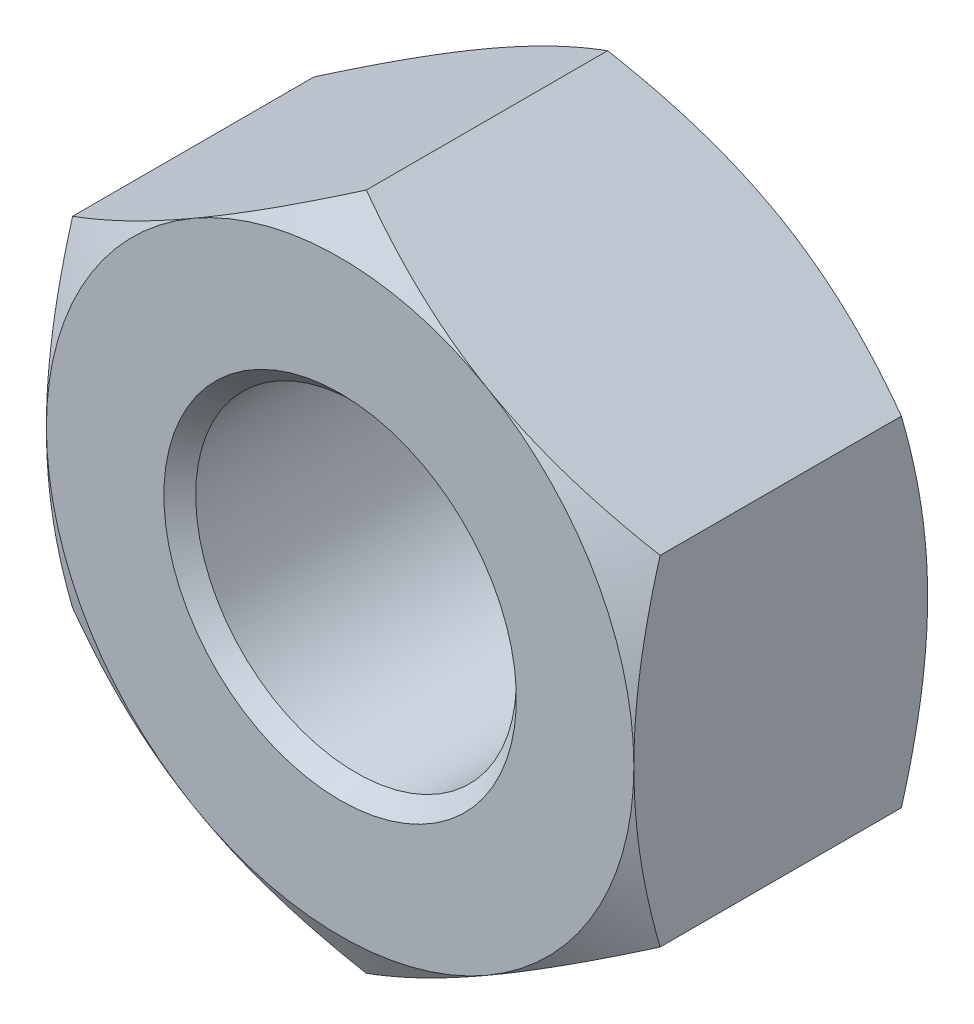
ISO-10303-21;
HEADER;
FILE_DESCRIPTION(('STEP AP214'),'2;1');
FILE_NAME('part.step','',(''),(''),'','','');
FILE_SCHEMA(('AUTOMOTIVE_DESIGN { 1 0 10303 214 1 1 1 1 }'));
ENDSEC;
DATA;
#1=APPLICATION_CONTEXT('core data for automotive mechanical design processes');
#2=APPLICATION_PROTOCOL_DEFINITION('international standard','automotive_design',2000,#1);
#3=PRODUCT_CONTEXT('',#1,'mechanical');
#4=PRODUCT('Part','Part','',(#3));
#5=PRODUCT_RELATED_PRODUCT_CATEGORY('part','',(#4));
#6=PRODUCT_DEFINITION_FORMATION('','',#4);
#7=PRODUCT_DEFINITION_CONTEXT('part definition',#1,'design');
#8=PRODUCT_DEFINITION('design','',#6,#7);
#9=PRODUCT_DEFINITION_SHAPE('','',#8);
#10=(LENGTH_UNIT() NAMED_UNIT(*) SI_UNIT(.MILLI.,.METRE.));
#11=(NAMED_UNIT(*) PLANE_ANGLE_UNIT() SI_UNIT($,.RADIAN.));
#12=(NAMED_UNIT(*) SI_UNIT($,.STERADIAN.) SOLID_ANGLE_UNIT());
#13=UNCERTAINTY_MEASURE_WITH_UNIT(LENGTH_MEASURE(1.E-05),#10,'distance_accuracy_value','');
#14=(GEOMETRIC_REPRESENTATION_CONTEXT(3) GLOBAL_UNCERTAINTY_ASSIGNED_CONTEXT((#13)) GLOBAL_UNIT_ASSIGNED_CONTEXT((#10,
#11,#12)) REPRESENTATION_CONTEXT('',''));
#15=CARTESIAN_POINT('',(0.,0.,0.));
#16=DIRECTION('',(0.,0.,1.));
#17=DIRECTION('',(1.,0.,0.));
#18=AXIS2_PLACEMENT_3D('',#15,#16,#17);
#19=CARTESIAN_POINT('',(2.5,-4.33012701892219,-1.));
#20=DIRECTION('',(0.5,-0.866025403784439,0.));
#21=DIRECTION('',(0.,0.,-1.));
#22=AXIS2_PLACEMENT_3D('',#19,#20,#21);
#23=PLANE('',#22);
#24=CARTESIAN_POINT('',(5.00000000000003,-2.88675134594812,0.446581987385214));
#25=CARTESIAN_POINT('',(3.6602540378444,-3.66025403784439,0.));
#26=CARTESIAN_POINT('',(2.5,-4.33012701892219,0.));
#27=(BOUNDED_CURVE() B_SPLINE_CURVE(2,(#24,#25,#26),.UNSPECIFIED.,.F.,
.F.) B_SPLINE_CURVE_WITH_KNOTS((3,3),(0.00272976051745168,2.9316581987571),
.UNSPECIFIED.) CURVE() GEOMETRIC_REPRESENTATION_ITEM() RATIONAL_B_SPLINE_CURVE((1.00007075032021,
1.0379915664716,1.)) REPRESENTATION_ITEM(''));
#28=CARTESIAN_POINT('',(5.,-2.88675134594813,0.446581987385204));
#29=VERTEX_POINT('',#28);
#30=CARTESIAN_POINT('',(2.5,-4.33012701892219,0.));
#31=VERTEX_POINT('',#30);
#32=EDGE_CURVE('E211',#29,#31,#27,.T.);
#33=ORIENTED_EDGE('',*,*,#32,.F.);
#34=DIRECTION('',(0.,0.,1.));
#35=VECTOR('',#34,1.);
#36=CARTESIAN_POINT('',(5.,-2.88675134594813,-1.));
#37=LINE('',#36,#35);
#38=CARTESIAN_POINT('',(5.,-2.88675134594813,4.5534180126148));
#39=VERTEX_POINT('',#38);
#40=EDGE_CURVE('E10',#29,#39,#37,.T.);
#41=ORIENTED_EDGE('',*,*,#40,.T.);
#42=CARTESIAN_POINT('',(2.5,-4.33012701892219,5.));
#43=CARTESIAN_POINT('',(3.6602540378444,-3.66025403784438,5.));
#44=CARTESIAN_POINT('',(5.00000000000003,-2.88675134594812,4.5534180126148));
#45=(BOUNDED_CURVE() B_SPLINE_CURVE(2,(#42,#43,#44),.UNSPECIFIED.,.F.,
.F.) B_SPLINE_CURVE_WITH_KNOTS((3,3),(2.9316581987571,5.86058663699675),
.UNSPECIFIED.) CURVE() GEOMETRIC_REPRESENTATION_ITEM() RATIONAL_B_SPLINE_CURVE((1.,
1.03799156647161,1.00007075032021)) REPRESENTATION_ITEM(''));
#46=CARTESIAN_POINT('',(2.5,-4.33012701892219,5.));
#47=VERTEX_POINT('',#46);
#48=EDGE_CURVE('E247',#47,#39,#45,.T.);
#49=ORIENTED_EDGE('',*,*,#48,.F.);
#50=CARTESIAN_POINT('',(0.,-5.77350269189628,4.55341801261479));
#51=CARTESIAN_POINT('',(1.3397459621556,-5.00000000000001,5.));
#52=CARTESIAN_POINT('',(2.5,-4.33012701892219,5.));
#53=(BOUNDED_CURVE() B_SPLINE_CURVE(2,(#50,#51,#52),.UNSPECIFIED.,.F.,
.F.) B_SPLINE_CURVE_WITH_KNOTS((3,3),(0.00272976051745616,2.9316581987571),
.UNSPECIFIED.) CURVE() GEOMETRIC_REPRESENTATION_ITEM() RATIONAL_B_SPLINE_CURVE((1.00007075032021,
1.03799156647161,1.)) REPRESENTATION_ITEM(''));
#54=CARTESIAN_POINT('',(0.,-5.77350269189626,4.5534180126148));
#55=VERTEX_POINT('',#54);
#56=EDGE_CURVE('E191',#55,#47,#53,.T.);
#57=ORIENTED_EDGE('',*,*,#56,.F.);
#58=DIRECTION('',(0.,0.,1.));
#59=VECTOR('',#58,1.);
#60=CARTESIAN_POINT('',(0.,-5.77350269189626,-1.));
#61=LINE('',#60,#59);
#62=CARTESIAN_POINT('',(0.,-5.77350269189626,0.446581987385204));
#63=VERTEX_POINT('',#62);
#64=EDGE_CURVE('E291',#63,#55,#61,.T.);
#65=ORIENTED_EDGE('',*,*,#64,.F.);
#66=CARTESIAN_POINT('',(2.5,-4.33012701892219,0.));
#67=CARTESIAN_POINT('',(1.33974596215561,-5.00000000000001,0.));
#68=CARTESIAN_POINT('',(0.,-5.77350269189627,0.446581987385213));
#69=(BOUNDED_CURVE() B_SPLINE_CURVE(2,(#66,#67,#68),.UNSPECIFIED.,.F.,
.F.) B_SPLINE_CURVE_WITH_KNOTS((3,3),(2.9316581987571,5.86058663699674),
.UNSPECIFIED.) CURVE() GEOMETRIC_REPRESENTATION_ITEM() RATIONAL_B_SPLINE_CURVE((1.,
1.03799156647161,1.00007075032021)) REPRESENTATION_ITEM(''));
#70=EDGE_CURVE('E185',#31,#63,#69,.T.);
#71=ORIENTED_EDGE('',*,*,#70,.F.);
#72=EDGE_LOOP('',(#33,#41,#49,#57,#65,#71));
#73=FACE_BOUND('',#72,.T.);
#74=ADVANCED_FACE('F15',(#73),#23,.T.);
#75=CARTESIAN_POINT('',(5.,0.,-1.));
#76=DIRECTION('',(1.,0.,0.));
#77=DIRECTION('',(0.,0.,-1.));
#78=AXIS2_PLACEMENT_3D('',#75,#76,#77);
#79=PLANE('',#78);
#80=CARTESIAN_POINT('',(5.00000000000001,2.88675134594816,0.446581987385212));
#81=CARTESIAN_POINT('',(5.,1.33974596215563,0.));
#82=CARTESIAN_POINT('',(5.,0.,0.));
#83=(BOUNDED_CURVE() B_SPLINE_CURVE(2,(#80,#81,#82),.UNSPECIFIED.,.F.,
.F.) B_SPLINE_CURVE_WITH_KNOTS((3,3),(0.00272976051745535,2.9316581987571),
.UNSPECIFIED.) CURVE() GEOMETRIC_REPRESENTATION_ITEM() RATIONAL_B_SPLINE_CURVE((1.00007075032021,
1.0379915664716,1.)) REPRESENTATION_ITEM(''));
#84=CARTESIAN_POINT('',(5.,2.88675134594813,0.446581987385203));
#85=VERTEX_POINT('',#84);
#86=CARTESIAN_POINT('',(5.,0.,0.));
#87=VERTEX_POINT('',#86);
#88=EDGE_CURVE('E265',#85,#87,#83,.T.);
#89=ORIENTED_EDGE('',*,*,#88,.F.);
#90=DIRECTION('',(0.,0.,1.));
#91=VECTOR('',#90,1.);
#92=CARTESIAN_POINT('',(5.,2.88675134594813,-1.));
#93=LINE('',#92,#91);
#94=CARTESIAN_POINT('',(5.,2.88675134594813,4.5534180126148));
#95=VERTEX_POINT('',#94);
#96=EDGE_CURVE('E25',#85,#95,#93,.T.);
#97=ORIENTED_EDGE('',*,*,#96,.T.);
#98=CARTESIAN_POINT('',(5.,0.,5.));
#99=CARTESIAN_POINT('',(5.,1.33974596215562,5.));
#100=CARTESIAN_POINT('',(5.,2.88675134594816,4.55341801261479));
#101=(BOUNDED_CURVE() B_SPLINE_CURVE(2,(#98,#99,#100),.UNSPECIFIED.,.F.,
.F.) B_SPLINE_CURVE_WITH_KNOTS((3,3),(2.9316581987571,5.86058663699674),
.UNSPECIFIED.) CURVE() GEOMETRIC_REPRESENTATION_ITEM() RATIONAL_B_SPLINE_CURVE((1.,
1.0379915664716,1.00007075032021)) REPRESENTATION_ITEM(''));
#102=CARTESIAN_POINT('',(5.,0.,5.));
#103=VERTEX_POINT('',#102);
#104=EDGE_CURVE('E168',#103,#95,#101,.T.);
#105=ORIENTED_EDGE('',*,*,#104,.F.);
#106=CARTESIAN_POINT('',(5.00000000000001,-2.88675134594816,4.5534180126148));
#107=CARTESIAN_POINT('',(5.,-1.33974596215562,5.));
#108=CARTESIAN_POINT('',(5.,0.,5.));
#109=(BOUNDED_CURVE() B_SPLINE_CURVE(2,(#106,#107,#108),.UNSPECIFIED.,.F.,
.F.) B_SPLINE_CURVE_WITH_KNOTS((3,3),(0.00272976051745627,2.9316581987571),
.UNSPECIFIED.) CURVE() GEOMETRIC_REPRESENTATION_ITEM() RATIONAL_B_SPLINE_CURVE((1.00007075032021,
1.0379915664716,1.)) REPRESENTATION_ITEM(''));
#110=EDGE_CURVE('E280',#39,#103,#109,.T.);
#111=ORIENTED_EDGE('',*,*,#110,.F.);
#112=ORIENTED_EDGE('',*,*,#40,.F.);
#113=CARTESIAN_POINT('',(5.,0.,0.));
#114=CARTESIAN_POINT('',(5.,-1.33974596215563,0.));
#115=CARTESIAN_POINT('',(5.00000000000001,-2.88675134594816,0.446581987385213));
#116=(BOUNDED_CURVE() B_SPLINE_CURVE(2,(#113,#114,#115),.UNSPECIFIED.,.F.,
.F.) B_SPLINE_CURVE_WITH_KNOTS((3,3),(2.9316581987571,5.86058663699675),
.UNSPECIFIED.) CURVE() GEOMETRIC_REPRESENTATION_ITEM() RATIONAL_B_SPLINE_CURVE((1.,
1.0379915664716,1.00007075032021)) REPRESENTATION_ITEM(''));
#117=EDGE_CURVE('E218',#87,#29,#116,.T.);
#118=ORIENTED_EDGE('',*,*,#117,.F.);
#119=EDGE_LOOP('',(#89,#97,#105,#111,#112,#118));
#120=FACE_BOUND('',#119,.T.);
#121=ADVANCED_FACE('F480',(#120),#79,.T.);
#122=CARTESIAN_POINT('',(2.5,4.33012701892219,-1.));
#123=DIRECTION('',(0.5,0.866025403784439,0.));
#124=DIRECTION('',(0.,0.,-1.));
#125=AXIS2_PLACEMENT_3D('',#122,#123,#124);
#126=PLANE('',#125);
#127=CARTESIAN_POINT('',(0.,5.77350269189628,0.446581987385211));
#128=CARTESIAN_POINT('',(1.33974596215561,5.00000000000001,0.));
#129=CARTESIAN_POINT('',(2.5,4.33012701892219,0.));
#130=(BOUNDED_CURVE() B_SPLINE_CURVE(2,(#127,#128,#129),.UNSPECIFIED.,.F.,
.F.) B_SPLINE_CURVE_WITH_KNOTS((3,3),(0.0027297605174567,2.9316581987571),
.UNSPECIFIED.) CURVE() GEOMETRIC_REPRESENTATION_ITEM() RATIONAL_B_SPLINE_CURVE((1.00007075032021,
1.03799156647161,1.)) REPRESENTATION_ITEM(''));
#131=CARTESIAN_POINT('',(0.,5.77350269189626,0.446581987385204));
#132=VERTEX_POINT('',#131);
#133=CARTESIAN_POINT('',(2.5,4.33012701892219,0.));
#134=VERTEX_POINT('',#133);
#135=EDGE_CURVE('E315',#132,#134,#130,.T.);
#136=ORIENTED_EDGE('',*,*,#135,.F.);
#137=DIRECTION('',(0.,0.,1.));
#138=VECTOR('',#137,1.);
#139=CARTESIAN_POINT('',(0.,5.77350269189626,-1.));
#140=LINE('',#139,#138);
#141=CARTESIAN_POINT('',(0.,5.77350269189626,4.5534180126148));
#142=VERTEX_POINT('',#141);
#143=EDGE_CURVE('E189',#132,#142,#140,.T.);
#144=ORIENTED_EDGE('',*,*,#143,.T.);
#145=CARTESIAN_POINT('',(2.5,4.33012701892219,5.));
#146=CARTESIAN_POINT('',(1.33974596215561,5.00000000000001,5.));
#147=CARTESIAN_POINT('',(0.,5.77350269189628,4.55341801261479));
#148=(BOUNDED_CURVE() B_SPLINE_CURVE(2,(#145,#146,#147),.UNSPECIFIED.,.F.,
.F.) B_SPLINE_CURVE_WITH_KNOTS((3,3),(2.9316581987571,5.86058663699675),
.UNSPECIFIED.) CURVE() GEOMETRIC_REPRESENTATION_ITEM() RATIONAL_B_SPLINE_CURVE((1.,
1.03799156647163,1.00007075032021)) REPRESENTATION_ITEM(''));
#149=CARTESIAN_POINT('',(2.5,4.33012701892219,5.));
#150=VERTEX_POINT('',#149);
#151=EDGE_CURVE('E181',#150,#142,#148,.T.);
#152=ORIENTED_EDGE('',*,*,#151,.F.);
#153=CARTESIAN_POINT('',(5.00000000000002,2.88675134594811,4.55341801261479));
#154=CARTESIAN_POINT('',(3.6602540378444,3.66025403784438,5.));
#155=CARTESIAN_POINT('',(2.5,4.33012701892219,5.));
#156=(BOUNDED_CURVE() B_SPLINE_CURVE(2,(#153,#154,#155),.UNSPECIFIED.,.F.,
.F.) B_SPLINE_CURVE_WITH_KNOTS((3,3),(0.00272976051745257,2.9316581987571),
.UNSPECIFIED.) CURVE() GEOMETRIC_REPRESENTATION_ITEM() RATIONAL_B_SPLINE_CURVE((1.00007075032021,
1.03799156647162,1.)) REPRESENTATION_ITEM(''));
#157=EDGE_CURVE('E169',#95,#150,#156,.T.);
#158=ORIENTED_EDGE('',*,*,#157,.F.);
#159=ORIENTED_EDGE('',*,*,#96,.F.);
#160=CARTESIAN_POINT('',(2.5,4.33012701892219,0.));
#161=CARTESIAN_POINT('',(3.6602540378444,3.66025403784438,0.));
#162=CARTESIAN_POINT('',(5.00000000000002,2.88675134594811,0.44658198738521));
#163=(BOUNDED_CURVE() B_SPLINE_CURVE(2,(#160,#161,#162),.UNSPECIFIED.,.F.,
.F.) B_SPLINE_CURVE_WITH_KNOTS((3,3),(2.9316581987571,5.86058663699674),
.UNSPECIFIED.) CURVE() GEOMETRIC_REPRESENTATION_ITEM() RATIONAL_B_SPLINE_CURVE((1.,
1.0379915664716,1.00007075032021)) REPRESENTATION_ITEM(''));
#164=EDGE_CURVE('E410',#134,#85,#163,.T.);
#165=ORIENTED_EDGE('',*,*,#164,.F.);
#166=EDGE_LOOP('',(#136,#144,#152,#158,#159,#165));
#167=FACE_BOUND('',#166,.T.);
#168=ADVANCED_FACE('F188',(#167),#126,.T.);
#169=CARTESIAN_POINT('',(-2.5,-4.33012701892219,-1.));
#170=DIRECTION('',(-0.5,-0.866025403784439,0.));
#171=DIRECTION('',(-0.866025403784439,0.5,0.));
#172=AXIS2_PLACEMENT_3D('',#169,#170,#171);
#173=PLANE('',#172);
#174=CARTESIAN_POINT('',(-2.5,-4.33012701892219,0.));
#175=CARTESIAN_POINT('',(-3.66025403784439,-3.66025403784438,0.));
#176=CARTESIAN_POINT('',(-5.00000000000003,-2.88675134594812,0.446581987385214));
#177=(BOUNDED_CURVE() B_SPLINE_CURVE(2,(#174,#175,#176),.UNSPECIFIED.,.F.,
.F.) B_SPLINE_CURVE_WITH_KNOTS((3,3),(2.9316581987571,5.86058663699675),
.UNSPECIFIED.) CURVE() GEOMETRIC_REPRESENTATION_ITEM() RATIONAL_B_SPLINE_CURVE((1.,
1.03799156647159,1.00007075032021)) REPRESENTATION_ITEM(''));
#178=CARTESIAN_POINT('',(-2.5,-4.33012701892219,0.));
#179=VERTEX_POINT('',#178);
#180=CARTESIAN_POINT('',(-5.,-2.88675134594813,0.446581987385204));
#181=VERTEX_POINT('',#180);
#182=EDGE_CURVE('E121',#179,#181,#177,.T.);
#183=ORIENTED_EDGE('',*,*,#182,.F.);
#184=CARTESIAN_POINT('',(0.,-5.77350269189629,0.446581987385214));
#185=CARTESIAN_POINT('',(-1.33974596215561,-5.00000000000001,0.));
#186=CARTESIAN_POINT('',(-2.5,-4.33012701892219,0.));
#187=(BOUNDED_CURVE() B_SPLINE_CURVE(2,(#184,#185,#186),.UNSPECIFIED.,.F.,
.F.) B_SPLINE_CURVE_WITH_KNOTS((3,3),(0.00272976051745565,2.9316581987571),
.UNSPECIFIED.) CURVE() GEOMETRIC_REPRESENTATION_ITEM() RATIONAL_B_SPLINE_CURVE((1.00007075032021,
1.0379915664716,1.)) REPRESENTATION_ITEM(''));
#188=EDGE_CURVE('E364',#63,#179,#187,.T.);
#189=ORIENTED_EDGE('',*,*,#188,.F.);
#190=ORIENTED_EDGE('',*,*,#64,.T.);
#191=CARTESIAN_POINT('',(-2.5,-4.33012701892219,5.));
#192=CARTESIAN_POINT('',(-1.33974596215561,-5.00000000000001,5.));
#193=CARTESIAN_POINT('',(0.,-5.77350269189628,4.55341801261479));
#194=(BOUNDED_CURVE() B_SPLINE_CURVE(2,(#191,#192,#193),.UNSPECIFIED.,.F.,
.F.) B_SPLINE_CURVE_WITH_KNOTS((3,3),(2.93165819875709,5.86058663699674),
.UNSPECIFIED.) CURVE() GEOMETRIC_REPRESENTATION_ITEM() RATIONAL_B_SPLINE_CURVE((1.,
1.03799156647159,1.00007075032021)) REPRESENTATION_ITEM(''));
#195=CARTESIAN_POINT('',(-2.5,-4.33012701892219,5.));
#196=VERTEX_POINT('',#195);
#197=EDGE_CURVE('E200',#196,#55,#194,.T.);
#198=ORIENTED_EDGE('',*,*,#197,.F.);
#199=CARTESIAN_POINT('',(-5.00000000000002,-2.88675134594811,4.55341801261479));
#200=CARTESIAN_POINT('',(-3.66025403784439,-3.66025403784438,5.));
#201=CARTESIAN_POINT('',(-2.5,-4.33012701892219,5.));
#202=(BOUNDED_CURVE() B_SPLINE_CURVE(2,(#199,#200,#201),.UNSPECIFIED.,.F.,
.F.) B_SPLINE_CURVE_WITH_KNOTS((3,3),(0.00272976051745259,2.93165819875709),
.UNSPECIFIED.) CURVE() GEOMETRIC_REPRESENTATION_ITEM() RATIONAL_B_SPLINE_CURVE((1.00007075032021,
1.03799156647161,1.)) REPRESENTATION_ITEM(''));
#203=CARTESIAN_POINT('',(-5.,-2.88675134594813,4.5534180126148));
#204=VERTEX_POINT('',#203);
#205=EDGE_CURVE('E248',#204,#196,#202,.T.);
#206=ORIENTED_EDGE('',*,*,#205,.F.);
#207=DIRECTION('',(0.,0.,1.));
#208=VECTOR('',#207,1.);
#209=CARTESIAN_POINT('',(-5.,-2.88675134594813,-1.));
#210=LINE('',#209,#208);
#211=EDGE_CURVE('E278',#181,#204,#210,.T.);
#212=ORIENTED_EDGE('',*,*,#211,.F.);
#213=EDGE_LOOP('',(#183,#189,#190,#198,#206,#212));
#214=FACE_BOUND('',#213,.T.);
#215=ADVANCED_FACE('F459',(#214),#173,.T.);
#216=CARTESIAN_POINT('',(-5.,0.,-1.));
#217=DIRECTION('',(-1.,0.,0.));
#218=DIRECTION('',(0.,0.,1.));
#219=AXIS2_PLACEMENT_3D('',#216,#217,#218);
#220=PLANE('',#219);
#221=CARTESIAN_POINT('',(-5.,0.,0.));
#222=CARTESIAN_POINT('',(-5.,1.33974596215563,0.));
#223=CARTESIAN_POINT('',(-5.,2.88675134594816,0.446581987385212));
#224=(BOUNDED_CURVE() B_SPLINE_CURVE(2,(#221,#222,#223),.UNSPECIFIED.,.F.,
.F.) B_SPLINE_CURVE_WITH_KNOTS((3,3),(2.9316581987571,5.86058663699675),
.UNSPECIFIED.) CURVE() GEOMETRIC_REPRESENTATION_ITEM() RATIONAL_B_SPLINE_CURVE((1.,
1.03799156647161,1.00007075032021)) REPRESENTATION_ITEM(''));
#225=CARTESIAN_POINT('',(-5.,0.,0.));
#226=VERTEX_POINT('',#225);
#227=CARTESIAN_POINT('',(-5.,2.88675134594813,0.446581987385205));
#228=VERTEX_POINT('',#227);
#229=EDGE_CURVE('E253',#226,#228,#224,.T.);
#230=ORIENTED_EDGE('',*,*,#229,.F.);
#231=CARTESIAN_POINT('',(-5.00000000000001,-2.88675134594816,0.446581987385213));
#232=CARTESIAN_POINT('',(-5.,-1.33974596215563,0.));
#233=CARTESIAN_POINT('',(-5.,0.,0.));
#234=(BOUNDED_CURVE() B_SPLINE_CURVE(2,(#231,#232,#233),.UNSPECIFIED.,.F.,
.F.) B_SPLINE_CURVE_WITH_KNOTS((3,3),(0.00272976051745533,2.9316581987571),
.UNSPECIFIED.) CURVE() GEOMETRIC_REPRESENTATION_ITEM() RATIONAL_B_SPLINE_CURVE((1.00007075032021,
1.03799156647161,1.)) REPRESENTATION_ITEM(''));
#235=EDGE_CURVE('E358',#181,#226,#234,.T.);
#236=ORIENTED_EDGE('',*,*,#235,.F.);
#237=ORIENTED_EDGE('',*,*,#211,.T.);
#238=CARTESIAN_POINT('',(-5.,0.,5.));
#239=CARTESIAN_POINT('',(-5.,-1.33974596215563,5.));
#240=CARTESIAN_POINT('',(-5.,-2.88675134594816,4.55341801261479));
#241=(BOUNDED_CURVE() B_SPLINE_CURVE(2,(#238,#239,#240),.UNSPECIFIED.,.F.,
.F.) B_SPLINE_CURVE_WITH_KNOTS((3,3),(2.9316581987571,5.86058663699675),
.UNSPECIFIED.) CURVE() GEOMETRIC_REPRESENTATION_ITEM() RATIONAL_B_SPLINE_CURVE((1.,
1.03799156647161,1.00007075032021)) REPRESENTATION_ITEM(''));
#242=CARTESIAN_POINT('',(-5.,0.,5.));
#243=VERTEX_POINT('',#242);
#244=EDGE_CURVE('E329',#243,#204,#241,.T.);
#245=ORIENTED_EDGE('',*,*,#244,.F.);
#246=CARTESIAN_POINT('',(-5.00000000000001,2.88675134594816,4.5534180126148));
#247=CARTESIAN_POINT('',(-5.,1.33974596215563,5.));
#248=CARTESIAN_POINT('',(-5.,0.,5.));
#249=(BOUNDED_CURVE() B_SPLINE_CURVE(2,(#246,#247,#248),.UNSPECIFIED.,.F.,
.F.) B_SPLINE_CURVE_WITH_KNOTS((3,3),(0.00272976051745625,2.9316581987571),
.UNSPECIFIED.) CURVE() GEOMETRIC_REPRESENTATION_ITEM() RATIONAL_B_SPLINE_CURVE((1.00007075032021,
1.03799156647161,1.)) REPRESENTATION_ITEM(''));
#250=CARTESIAN_POINT('',(-5.,2.88675134594813,4.5534180126148));
#251=VERTEX_POINT('',#250);
#252=EDGE_CURVE('E397',#251,#243,#249,.T.);
#253=ORIENTED_EDGE('',*,*,#252,.F.);
#254=DIRECTION('',(0.,0.,1.));
#255=VECTOR('',#254,1.);
#256=CARTESIAN_POINT('',(-5.,2.88675134594813,-1.));
#257=LINE('',#256,#255);
#258=EDGE_CURVE('E266',#228,#251,#257,.T.);
#259=ORIENTED_EDGE('',*,*,#258,.F.);
#260=EDGE_LOOP('',(#230,#236,#237,#245,#253,#259));
#261=FACE_BOUND('',#260,.T.);
#262=ADVANCED_FACE('F467',(#261),#220,.T.);
#263=CARTESIAN_POINT('',(-2.5,4.33012701892219,-1.));
#264=DIRECTION('',(-0.5,0.866025403784439,0.));
#265=DIRECTION('',(0.,0.,1.));
#266=AXIS2_PLACEMENT_3D('',#263,#264,#265);
#267=PLANE('',#266);
#268=CARTESIAN_POINT('',(-2.5,4.33012701892219,0.));
#269=CARTESIAN_POINT('',(-1.33974596215561,5.00000000000001,0.));
#270=CARTESIAN_POINT('',(0.,5.77350269189628,0.446581987385212));
#271=(BOUNDED_CURVE() B_SPLINE_CURVE(2,(#268,#269,#270),.UNSPECIFIED.,.F.,
.F.) B_SPLINE_CURVE_WITH_KNOTS((3,3),(2.9316581987571,5.86058663699674),
.UNSPECIFIED.) CURVE() GEOMETRIC_REPRESENTATION_ITEM() RATIONAL_B_SPLINE_CURVE((1.,
1.03799156647159,1.00007075032021)) REPRESENTATION_ITEM(''));
#272=CARTESIAN_POINT('',(-2.5,4.33012701892219,0.));
#273=VERTEX_POINT('',#272);
#274=EDGE_CURVE('E307',#273,#132,#271,.T.);
#275=ORIENTED_EDGE('',*,*,#274,.F.);
#276=CARTESIAN_POINT('',(-5.00000000000003,2.88675134594812,0.446581987385214));
#277=CARTESIAN_POINT('',(-3.6602540378444,3.66025403784438,0.));
#278=CARTESIAN_POINT('',(-2.5,4.33012701892219,0.));
#279=(BOUNDED_CURVE() B_SPLINE_CURVE(2,(#276,#277,#278),.UNSPECIFIED.,.F.,
.F.) B_SPLINE_CURVE_WITH_KNOTS((3,3),(0.00272976051745146,2.9316581987571),
.UNSPECIFIED.) CURVE() GEOMETRIC_REPRESENTATION_ITEM() RATIONAL_B_SPLINE_CURVE((1.00007075032021,
1.03799156647159,1.)) REPRESENTATION_ITEM(''));
#280=EDGE_CURVE('E254',#228,#273,#279,.T.);
#281=ORIENTED_EDGE('',*,*,#280,.F.);
#282=ORIENTED_EDGE('',*,*,#258,.T.);
#283=CARTESIAN_POINT('',(-2.5,4.33012701892219,5.));
#284=CARTESIAN_POINT('',(-3.66025403784439,3.66025403784439,5.));
#285=CARTESIAN_POINT('',(-5.00000000000003,2.88675134594812,4.5534180126148));
#286=(BOUNDED_CURVE() B_SPLINE_CURVE(2,(#283,#284,#285),.UNSPECIFIED.,.F.,
.F.) B_SPLINE_CURVE_WITH_KNOTS((3,3),(2.93165819875709,5.86058663699674),
.UNSPECIFIED.) CURVE() GEOMETRIC_REPRESENTATION_ITEM() RATIONAL_B_SPLINE_CURVE((1.,
1.03799156647161,1.00007075032021)) REPRESENTATION_ITEM(''));
#287=CARTESIAN_POINT('',(-2.5,4.33012701892219,5.));
#288=VERTEX_POINT('',#287);
#289=EDGE_CURVE('E339',#288,#251,#286,.T.);
#290=ORIENTED_EDGE('',*,*,#289,.F.);
#291=CARTESIAN_POINT('',(0.,5.77350269189629,4.5534180126148));
#292=CARTESIAN_POINT('',(-1.3397459621556,5.00000000000001,5.));
#293=CARTESIAN_POINT('',(-2.5,4.33012701892219,5.));
#294=(BOUNDED_CURVE() B_SPLINE_CURVE(2,(#291,#292,#293),.UNSPECIFIED.,.F.,
.F.) B_SPLINE_CURVE_WITH_KNOTS((3,3),(0.00272976051745433,2.93165819875709),
.UNSPECIFIED.) CURVE() GEOMETRIC_REPRESENTATION_ITEM() RATIONAL_B_SPLINE_CURVE((1.00007075032021,
1.03799156647158,1.)) REPRESENTATION_ITEM(''));
#295=EDGE_CURVE('E183',#142,#288,#294,.T.);
#296=ORIENTED_EDGE('',*,*,#295,.F.);
#297=ORIENTED_EDGE('',*,*,#143,.F.);
#298=EDGE_LOOP('',(#275,#281,#282,#290,#296,#297));
#299=FACE_BOUND('',#298,.T.);
#300=ADVANCED_FACE('F486',(#299),#267,.T.);
#301=CARTESIAN_POINT('',(0.,-4.,0.));
#302=DIRECTION('',(0.,0.,-1.));
#303=DIRECTION('',(0.,-1.,0.));
#304=AXIS2_PLACEMENT_3D('',#301,#302,#303);
#305=PLANE('',#304);
#306=CARTESIAN_POINT('',(0.,0.,0.));
#307=DIRECTION('',(0.,0.,1.));
#308=DIRECTION('',(0.,-1.,0.));
#309=AXIS2_PLACEMENT_3D('',#306,#307,#308);
#310=CIRCLE('',#309,3.);
#311=CARTESIAN_POINT('',(0.,3.,0.));
#312=VERTEX_POINT('',#311);
#313=EDGE_CURVE('E230',#312,#312,#310,.T.);
#314=ORIENTED_EDGE('',*,*,#313,.T.);
#315=EDGE_LOOP('',(#314));
#316=FACE_BOUND('',#315,.T.);
#317=CARTESIAN_POINT('',(0.,0.,0.));
#318=DIRECTION('',(0.,0.,1.));
#319=DIRECTION('',(0.,-1.,0.));
#320=AXIS2_PLACEMENT_3D('',#317,#318,#319);
#321=CIRCLE('',#320,5.);
#322=EDGE_CURVE('E365',#179,#31,#321,.T.);
#323=ORIENTED_EDGE('',*,*,#322,.F.);
#324=CARTESIAN_POINT('',(0.,0.,0.));
#325=DIRECTION('',(0.,0.,1.));
#326=DIRECTION('',(0.,-1.,0.));
#327=AXIS2_PLACEMENT_3D('',#324,#325,#326);
#328=CIRCLE('',#327,5.);
#329=EDGE_CURVE('E306',#226,#179,#328,.T.);
#330=ORIENTED_EDGE('',*,*,#329,.F.);
#331=CARTESIAN_POINT('',(0.,0.,0.));
#332=DIRECTION('',(0.,0.,1.));
#333=DIRECTION('',(0.,-1.,0.));
#334=AXIS2_PLACEMENT_3D('',#331,#332,#333);
#335=CIRCLE('',#334,5.);
#336=EDGE_CURVE('E249',#273,#226,#335,.T.);
#337=ORIENTED_EDGE('',*,*,#336,.F.);
#338=CARTESIAN_POINT('',(0.,0.,0.));
#339=DIRECTION('',(0.,0.,1.));
#340=DIRECTION('',(0.,-1.,0.));
#341=AXIS2_PLACEMENT_3D('',#338,#339,#340);
#342=CIRCLE('',#341,5.);
#343=EDGE_CURVE('E316',#134,#273,#342,.T.);
#344=ORIENTED_EDGE('',*,*,#343,.F.);
#345=CARTESIAN_POINT('',(0.,0.,0.));
#346=DIRECTION('',(0.,0.,1.));
#347=DIRECTION('',(0.,-1.,0.));
#348=AXIS2_PLACEMENT_3D('',#345,#346,#347);
#349=CIRCLE('',#348,5.);
#350=EDGE_CURVE('E112',#87,#134,#349,.T.);
#351=ORIENTED_EDGE('',*,*,#350,.F.);
#352=CARTESIAN_POINT('',(0.,0.,0.));
#353=DIRECTION('',(0.,0.,1.));
#354=DIRECTION('',(0.,-1.,0.));
#355=AXIS2_PLACEMENT_3D('',#352,#353,#354);
#356=CIRCLE('',#355,5.);
#357=EDGE_CURVE('E176',#31,#87,#356,.T.);
#358=ORIENTED_EDGE('',*,*,#357,.F.);
#359=EDGE_LOOP('',(#323,#330,#337,#344,#351,#358));
#360=FACE_BOUND('',#359,.T.);
#361=ADVANCED_FACE('F474',(#316,#360),#305,.T.);
#362=CARTESIAN_POINT('',(0.,-4.,5.));
#363=DIRECTION('',(0.,0.,1.));
#364=DIRECTION('',(1.,0.,0.));
#365=AXIS2_PLACEMENT_3D('',#362,#363,#364);
#366=PLANE('',#365);
#367=CARTESIAN_POINT('',(0.,0.,5.));
#368=DIRECTION('',(0.,0.,1.));
#369=DIRECTION('',(0.,-1.,0.));
#370=AXIS2_PLACEMENT_3D('',#367,#368,#369);
#371=CIRCLE('',#370,3.);
#372=CARTESIAN_POINT('',(0.,3.,5.));
#373=VERTEX_POINT('',#372);
#374=EDGE_CURVE('E239',#373,#373,#371,.T.);
#375=ORIENTED_EDGE('',*,*,#374,.F.);
#376=EDGE_LOOP('',(#375));
#377=FACE_BOUND('',#376,.T.);
#378=CARTESIAN_POINT('',(0.,0.,5.));
#379=DIRECTION('',(0.,0.,1.));
#380=DIRECTION('',(0.,-1.,0.));
#381=AXIS2_PLACEMENT_3D('',#378,#379,#380);
#382=CIRCLE('',#381,5.);
#383=EDGE_CURVE('E240',#196,#47,#382,.T.);
#384=ORIENTED_EDGE('',*,*,#383,.T.);
#385=CARTESIAN_POINT('',(0.,0.,5.));
#386=DIRECTION('',(0.,0.,1.));
#387=DIRECTION('',(0.,-1.,0.));
#388=AXIS2_PLACEMENT_3D('',#385,#386,#387);
#389=CIRCLE('',#388,5.);
#390=EDGE_CURVE('E163',#47,#103,#389,.T.);
#391=ORIENTED_EDGE('',*,*,#390,.T.);
#392=CARTESIAN_POINT('',(0.,0.,5.));
#393=DIRECTION('',(0.,0.,1.));
#394=DIRECTION('',(0.,-1.,0.));
#395=AXIS2_PLACEMENT_3D('',#392,#393,#394);
#396=CIRCLE('',#395,5.);
#397=EDGE_CURVE('E155',#103,#150,#396,.T.);
#398=ORIENTED_EDGE('',*,*,#397,.T.);
#399=CARTESIAN_POINT('',(0.,0.,5.));
#400=DIRECTION('',(0.,0.,1.));
#401=DIRECTION('',(0.,-1.,0.));
#402=AXIS2_PLACEMENT_3D('',#399,#400,#401);
#403=CIRCLE('',#402,5.);
#404=EDGE_CURVE('E161',#150,#288,#403,.T.);
#405=ORIENTED_EDGE('',*,*,#404,.T.);
#406=CARTESIAN_POINT('',(0.,0.,5.));
#407=DIRECTION('',(0.,0.,1.));
#408=DIRECTION('',(0.,-1.,0.));
#409=AXIS2_PLACEMENT_3D('',#406,#407,#408);
#410=CIRCLE('',#409,5.);
#411=EDGE_CURVE('E206',#288,#243,#410,.T.);
#412=ORIENTED_EDGE('',*,*,#411,.T.);
#413=CARTESIAN_POINT('',(0.,0.,5.));
#414=DIRECTION('',(0.,0.,1.));
#415=DIRECTION('',(0.,-1.,0.));
#416=AXIS2_PLACEMENT_3D('',#413,#414,#415);
#417=CIRCLE('',#416,5.);
#418=EDGE_CURVE('E243',#243,#196,#417,.T.);
#419=ORIENTED_EDGE('',*,*,#418,.T.);
#420=EDGE_LOOP('',(#384,#391,#398,#405,#412,#419));
#421=FACE_BOUND('',#420,.T.);
#422=ADVANCED_FACE('F158',(#377,#421),#366,.T.);
#423=CARTESIAN_POINT('',(0.,0.,4.77627677068902));
#424=DIRECTION('',(0.,0.,-1.));
#425=DIRECTION('',(0.,-1.,0.));
#426=AXIS2_PLACEMENT_3D('',#423,#424,#425);
#427=CONICAL_SURFACE('',#426,5.3875,1.0471975511966);
#428=ORIENTED_EDGE('',*,*,#48,.T.);
#429=ORIENTED_EDGE('',*,*,#110,.T.);
#430=ORIENTED_EDGE('',*,*,#390,.F.);
#431=EDGE_LOOP('',(#428,#429,#430));
#432=FACE_BOUND('',#431,.T.);
#433=ADVANCED_FACE('F501',(#432),#427,.T.);
#434=CARTESIAN_POINT('',(0.,0.,4.77627677068902));
#435=DIRECTION('',(0.,0.,-1.));
#436=DIRECTION('',(0.,-1.,0.));
#437=AXIS2_PLACEMENT_3D('',#434,#435,#436);
#438=CONICAL_SURFACE('',#437,5.3875,1.0471975511966);
#439=ORIENTED_EDGE('',*,*,#244,.T.);
#440=ORIENTED_EDGE('',*,*,#205,.T.);
#441=ORIENTED_EDGE('',*,*,#418,.F.);
#442=EDGE_LOOP('',(#439,#440,#441));
#443=FACE_BOUND('',#442,.T.);
#444=ADVANCED_FACE('F17',(#443),#438,.T.);
#445=CARTESIAN_POINT('',(0.,0.,4.77627677068902));
#446=DIRECTION('',(0.,0.,-1.));
#447=DIRECTION('',(0.,-1.,0.));
#448=AXIS2_PLACEMENT_3D('',#445,#446,#447);
#449=CONICAL_SURFACE('',#448,5.3875,1.0471975511966);
#450=ORIENTED_EDGE('',*,*,#252,.T.);
#451=ORIENTED_EDGE('',*,*,#411,.F.);
#452=ORIENTED_EDGE('',*,*,#289,.T.);
#453=EDGE_LOOP('',(#450,#451,#452));
#454=FACE_BOUND('',#453,.T.);
#455=ADVANCED_FACE('F488',(#454),#449,.T.);
#456=CARTESIAN_POINT('',(0.,0.,4.77627677068902));
#457=DIRECTION('',(0.,0.,-1.));
#458=DIRECTION('',(0.,-1.,0.));
#459=AXIS2_PLACEMENT_3D('',#456,#457,#458);
#460=CONICAL_SURFACE('',#459,5.3875,1.0471975511966);
#461=ORIENTED_EDGE('',*,*,#157,.T.);
#462=ORIENTED_EDGE('',*,*,#397,.F.);
#463=ORIENTED_EDGE('',*,*,#104,.T.);
#464=EDGE_LOOP('',(#461,#462,#463));
#465=FACE_BOUND('',#464,.T.);
#466=ADVANCED_FACE('F171',(#465),#460,.T.);
#467=CARTESIAN_POINT('',(0.,0.,0.22372322931098));
#468=DIRECTION('',(0.,0.,1.));
#469=DIRECTION('',(0.,-1.,0.));
#470=AXIS2_PLACEMENT_3D('',#467,#468,#469);
#471=CONICAL_SURFACE('',#470,5.3875,1.0471975511966);
#472=ORIENTED_EDGE('',*,*,#117,.T.);
#473=ORIENTED_EDGE('',*,*,#32,.T.);
#474=ORIENTED_EDGE('',*,*,#357,.T.);
#475=EDGE_LOOP('',(#472,#473,#474));
#476=FACE_BOUND('',#475,.T.);
#477=ADVANCED_FACE('F477',(#476),#471,.T.);
#478=CARTESIAN_POINT('',(0.,0.,0.22372322931098));
#479=DIRECTION('',(0.,0.,1.));
#480=DIRECTION('',(0.,-1.,0.));
#481=AXIS2_PLACEMENT_3D('',#478,#479,#480);
#482=CONICAL_SURFACE('',#481,5.3875,1.0471975511966);
#483=ORIENTED_EDGE('',*,*,#164,.T.);
#484=ORIENTED_EDGE('',*,*,#88,.T.);
#485=ORIENTED_EDGE('',*,*,#350,.T.);
#486=EDGE_LOOP('',(#483,#484,#485));
#487=FACE_BOUND('',#486,.T.);
#488=ADVANCED_FACE('F482',(#487),#482,.T.);
#489=CARTESIAN_POINT('',(0.,0.,0.22372322931098));
#490=DIRECTION('',(0.,0.,1.));
#491=DIRECTION('',(0.,-1.,0.));
#492=AXIS2_PLACEMENT_3D('',#489,#490,#491);
#493=CONICAL_SURFACE('',#492,5.3875,1.0471975511966);
#494=ORIENTED_EDGE('',*,*,#280,.T.);
#495=ORIENTED_EDGE('',*,*,#336,.T.);
#496=ORIENTED_EDGE('',*,*,#229,.T.);
#497=EDGE_LOOP('',(#494,#495,#496));
#498=FACE_BOUND('',#497,.T.);
#499=ADVANCED_FACE('F533',(#498),#493,.T.);
#500=CARTESIAN_POINT('',(0.,0.,0.22372322931098));
#501=DIRECTION('',(0.,0.,1.));
#502=DIRECTION('',(0.,-1.,0.));
#503=AXIS2_PLACEMENT_3D('',#500,#501,#502);
#504=CONICAL_SURFACE('',#503,5.3875,1.0471975511966);
#505=ORIENTED_EDGE('',*,*,#235,.T.);
#506=ORIENTED_EDGE('',*,*,#329,.T.);
#507=ORIENTED_EDGE('',*,*,#182,.T.);
#508=EDGE_LOOP('',(#505,#506,#507));
#509=FACE_BOUND('',#508,.T.);
#510=ADVANCED_FACE('F470',(#509),#504,.T.);
#511=CARTESIAN_POINT('',(0.,0.,0.22372322931098));
#512=DIRECTION('',(0.,0.,1.));
#513=DIRECTION('',(0.,-1.,0.));
#514=AXIS2_PLACEMENT_3D('',#511,#512,#513);
#515=CONICAL_SURFACE('',#514,5.3875,1.0471975511966);
#516=ORIENTED_EDGE('',*,*,#343,.T.);
#517=ORIENTED_EDGE('',*,*,#274,.T.);
#518=ORIENTED_EDGE('',*,*,#135,.T.);
#519=EDGE_LOOP('',(#516,#517,#518));
#520=FACE_BOUND('',#519,.T.);
#521=ADVANCED_FACE('F484',(#520),#515,.T.);
#522=CARTESIAN_POINT('',(0.,0.,0.22372322931098));
#523=DIRECTION('',(0.,0.,1.));
#524=DIRECTION('',(0.,-1.,0.));
#525=AXIS2_PLACEMENT_3D('',#522,#523,#524);
#526=CONICAL_SURFACE('',#525,5.3875,1.0471975511966);
#527=ORIENTED_EDGE('',*,*,#70,.T.);
#528=ORIENTED_EDGE('',*,*,#188,.T.);
#529=ORIENTED_EDGE('',*,*,#322,.T.);
#530=EDGE_LOOP('',(#527,#528,#529));
#531=FACE_BOUND('',#530,.T.);
#532=ADVANCED_FACE('F476',(#531),#526,.T.);
#533=CARTESIAN_POINT('',(0.,0.,4.77627677068902));
#534=DIRECTION('',(0.,0.,-1.));
#535=DIRECTION('',(0.,-1.,0.));
#536=AXIS2_PLACEMENT_3D('',#533,#534,#535);
#537=CONICAL_SURFACE('',#536,5.3875,1.0471975511966);
#538=ORIENTED_EDGE('',*,*,#151,.T.);
#539=ORIENTED_EDGE('',*,*,#295,.T.);
#540=ORIENTED_EDGE('',*,*,#404,.F.);
#541=EDGE_LOOP('',(#538,#539,#540));
#542=FACE_BOUND('',#541,.T.);
#543=ADVANCED_FACE('F180',(#542),#537,.T.);
#544=CARTESIAN_POINT('',(0.,0.,4.77627677068902));
#545=DIRECTION('',(0.,0.,-1.));
#546=DIRECTION('',(0.,-1.,0.));
#547=AXIS2_PLACEMENT_3D('',#544,#545,#546);
#548=CONICAL_SURFACE('',#547,5.3875,1.0471975511966);
#549=ORIENTED_EDGE('',*,*,#383,.F.);
#550=ORIENTED_EDGE('',*,*,#197,.T.);
#551=ORIENTED_EDGE('',*,*,#56,.T.);
#552=EDGE_LOOP('',(#549,#550,#551));
#553=FACE_BOUND('',#552,.T.);
#554=ADVANCED_FACE('F463',(#553),#548,.T.);
#555=CARTESIAN_POINT('',(0.,0.,4.8646875));
#556=DIRECTION('',(0.,0.,1.));
#557=DIRECTION('',(0.,-1.,0.));
#558=AXIS2_PLACEMENT_3D('',#555,#556,#557);
#559=CONICAL_SURFACE('',#558,2.8646875,0.785398163397448);
#560=CARTESIAN_POINT('',(0.,0.,4.729375));
#561=DIRECTION('',(0.,0.,1.));
#562=DIRECTION('',(0.,-1.,0.));
#563=AXIS2_PLACEMENT_3D('',#560,#561,#562);
#564=CIRCLE('',#563,2.729375);
#565=CARTESIAN_POINT('',(0.,2.729375,4.729375));
#566=VERTEX_POINT('',#565);
#567=EDGE_CURVE('E235',#566,#566,#564,.T.);
#568=ORIENTED_EDGE('',*,*,#567,.F.);
#569=EDGE_LOOP('',(#568));
#570=FACE_BOUND('',#569,.T.);
#571=ORIENTED_EDGE('',*,*,#374,.T.);
#572=EDGE_LOOP('',(#571));
#573=FACE_BOUND('',#572,.T.);
#574=ADVANCED_FACE('F527',(#570,#573),#559,.F.);
#575=CARTESIAN_POINT('',(0.,0.,2.5));
#576=DIRECTION('',(0.,0.,1.));
#577=DIRECTION('',(0.,-1.,0.));
#578=AXIS2_PLACEMENT_3D('',#575,#576,#577);
#579=CYLINDRICAL_SURFACE('',#578,2.729375);
#580=CARTESIAN_POINT('',(0.,0.,0.270625));
#581=DIRECTION('',(0.,0.,1.));
#582=DIRECTION('',(0.,-1.,0.));
#583=AXIS2_PLACEMENT_3D('',#580,#581,#582);
#584=CIRCLE('',#583,2.729375);
#585=CARTESIAN_POINT('',(0.,2.729375,0.270625));
#586=VERTEX_POINT('',#585);
#587=EDGE_CURVE('E236',#586,#586,#584,.T.);
#588=ORIENTED_EDGE('',*,*,#587,.F.);
#589=EDGE_LOOP('',(#588));
#590=FACE_BOUND('',#589,.T.);
#591=ORIENTED_EDGE('',*,*,#567,.T.);
#592=EDGE_LOOP('',(#591));
#593=FACE_BOUND('',#592,.T.);
#594=ADVANCED_FACE('F517',(#590,#593),#579,.F.);
#595=CARTESIAN_POINT('',(0.,0.,0.1353125));
#596=DIRECTION('',(0.,0.,-1.));
#597=DIRECTION('',(0.,-1.,0.));
#598=AXIS2_PLACEMENT_3D('',#595,#596,#597);
#599=CONICAL_SURFACE('',#598,2.8646875,0.785398163397448);
#600=ORIENTED_EDGE('',*,*,#313,.F.);
#601=EDGE_LOOP('',(#600));
#602=FACE_BOUND('',#601,.T.);
#603=ORIENTED_EDGE('',*,*,#587,.T.);
#604=EDGE_LOOP('',(#603));
#605=FACE_BOUND('',#604,.T.);
#606=ADVANCED_FACE('F514',(#602,#605),#599,.F.);
#607=CLOSED_SHELL('',(#74,#121,#168,#215,#262,#300,#361,#422,#433,#444,#455,#466,#477,#488,#499,
#510,#521,#532,#543,#554,#574,#594,#606));
#608=MANIFOLD_SOLID_BREP('B1',#607);
#609=ADVANCED_BREP_SHAPE_REPRESENTATION('',(#18,#608),#14);
#610=SHAPE_DEFINITION_REPRESENTATION(#9,#609);
ENDSEC;
END-ISO-10303-21;
